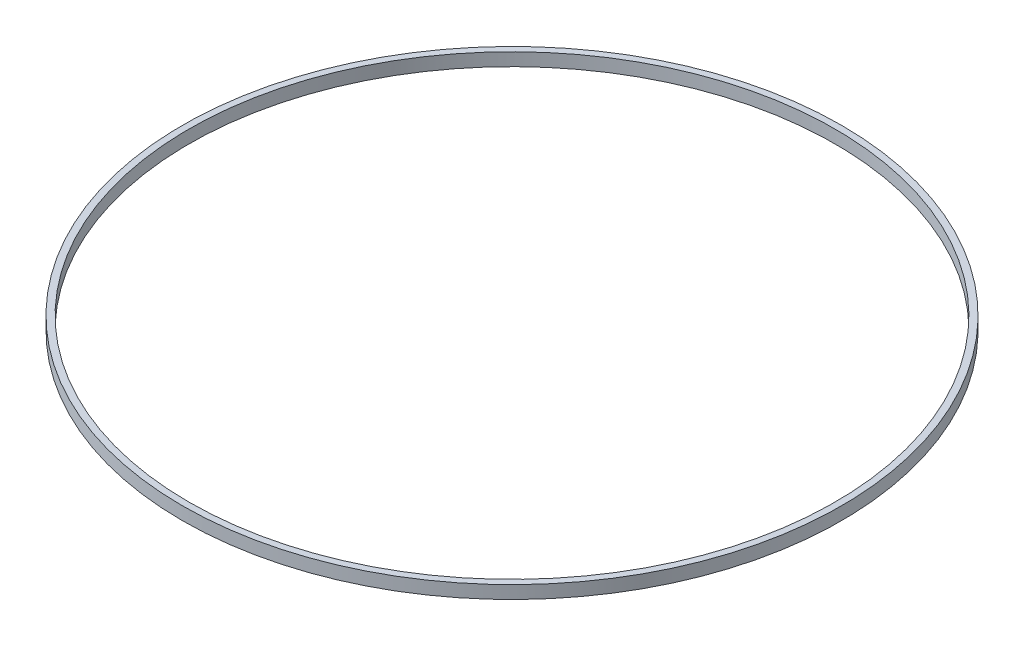
ISO-10303-21;
HEADER;
FILE_DESCRIPTION(('STEP AP214'),'2;1');
FILE_NAME('part.step','',(''),(''),'','','');
FILE_SCHEMA(('AUTOMOTIVE_DESIGN { 1 0 10303 214 1 1 1 1 }'));
ENDSEC;
DATA;
#1=APPLICATION_CONTEXT('core data for automotive mechanical design processes');
#2=APPLICATION_PROTOCOL_DEFINITION('international standard','automotive_design',2000,#1);
#3=PRODUCT_CONTEXT('',#1,'mechanical');
#4=PRODUCT('Part','Part','',(#3));
#5=PRODUCT_RELATED_PRODUCT_CATEGORY('part','',(#4));
#6=PRODUCT_DEFINITION_FORMATION('','',#4);
#7=PRODUCT_DEFINITION_CONTEXT('part definition',#1,'design');
#8=PRODUCT_DEFINITION('design','',#6,#7);
#9=PRODUCT_DEFINITION_SHAPE('','',#8);
#10=(LENGTH_UNIT() NAMED_UNIT(*) SI_UNIT(.MILLI.,.METRE.));
#11=(NAMED_UNIT(*) PLANE_ANGLE_UNIT() SI_UNIT($,.RADIAN.));
#12=(NAMED_UNIT(*) SI_UNIT($,.STERADIAN.) SOLID_ANGLE_UNIT());
#13=UNCERTAINTY_MEASURE_WITH_UNIT(LENGTH_MEASURE(1.E-05),#10,'distance_accuracy_value','');
#14=(GEOMETRIC_REPRESENTATION_CONTEXT(3) GLOBAL_UNCERTAINTY_ASSIGNED_CONTEXT((#13)) GLOBAL_UNIT_ASSIGNED_CONTEXT((#10,
#11,#12)) REPRESENTATION_CONTEXT('',''));
#15=CARTESIAN_POINT('',(0.,0.,0.));
#16=DIRECTION('',(0.,0.,1.));
#17=DIRECTION('',(1.,0.,0.));
#18=AXIS2_PLACEMENT_3D('',#15,#16,#17);
#19=CARTESIAN_POINT('',(0.,2.,0.));
#20=DIRECTION('',(0.,1.,0.));
#21=DIRECTION('',(0.,0.,1.));
#22=AXIS2_PLACEMENT_3D('',#19,#20,#21);
#23=PLANE('',#22);
#24=CARTESIAN_POINT('',(0.,2.,0.));
#25=DIRECTION('',(0.,1.,0.));
#26=DIRECTION('',(0.,0.,1.));
#27=AXIS2_PLACEMENT_3D('',#24,#25,#26);
#28=CIRCLE('',#27,51.);
#29=CARTESIAN_POINT('',(0.,2.,51.));
#30=VERTEX_POINT('',#29);
#31=EDGE_CURVE('E10',#30,#30,#28,.T.);
#32=ORIENTED_EDGE('',*,*,#31,.T.);
#33=EDGE_LOOP('',(#32));
#34=FACE_BOUND('',#33,.T.);
#35=CARTESIAN_POINT('',(0.,2.,0.));
#36=DIRECTION('',(0.,1.,0.));
#37=DIRECTION('',(0.,0.,1.));
#38=AXIS2_PLACEMENT_3D('',#35,#36,#37);
#39=CIRCLE('',#38,50.);
#40=CARTESIAN_POINT('',(0.,2.,50.));
#41=VERTEX_POINT('',#40);
#42=EDGE_CURVE('E42',#41,#41,#39,.T.);
#43=ORIENTED_EDGE('',*,*,#42,.F.);
#44=EDGE_LOOP('',(#43));
#45=FACE_BOUND('',#44,.T.);
#46=ADVANCED_FACE('F31',(#34,#45),#23,.T.);
#47=CARTESIAN_POINT('',(0.,0.,0.));
#48=DIRECTION('',(0.,1.,0.));
#49=DIRECTION('',(0.,0.,1.));
#50=AXIS2_PLACEMENT_3D('',#47,#48,#49);
#51=PLANE('',#50);
#52=CARTESIAN_POINT('',(0.,0.,0.));
#53=DIRECTION('',(0.,1.,0.));
#54=DIRECTION('',(0.,0.,1.));
#55=AXIS2_PLACEMENT_3D('',#52,#53,#54);
#56=CIRCLE('',#55,51.);
#57=CARTESIAN_POINT('',(0.,0.,51.));
#58=VERTEX_POINT('',#57);
#59=EDGE_CURVE('E35',#58,#58,#56,.T.);
#60=ORIENTED_EDGE('',*,*,#59,.F.);
#61=EDGE_LOOP('',(#60));
#62=FACE_BOUND('',#61,.T.);
#63=CARTESIAN_POINT('',(0.,0.,0.));
#64=DIRECTION('',(0.,1.,0.));
#65=DIRECTION('',(0.,0.,1.));
#66=AXIS2_PLACEMENT_3D('',#63,#64,#65);
#67=CIRCLE('',#66,50.);
#68=CARTESIAN_POINT('',(0.,0.,50.));
#69=VERTEX_POINT('',#68);
#70=EDGE_CURVE('E44',#69,#69,#67,.T.);
#71=ORIENTED_EDGE('',*,*,#70,.T.);
#72=EDGE_LOOP('',(#71));
#73=FACE_BOUND('',#72,.T.);
#74=ADVANCED_FACE('F54',(#62,#73),#51,.F.);
#75=CARTESIAN_POINT('',(0.,2.,0.));
#76=DIRECTION('',(0.,-1.,0.));
#77=DIRECTION('',(0.,0.,-1.));
#78=AXIS2_PLACEMENT_3D('',#75,#76,#77);
#79=CYLINDRICAL_SURFACE('',#78,51.);
#80=ORIENTED_EDGE('',*,*,#31,.F.);
#81=EDGE_LOOP('',(#80));
#82=FACE_BOUND('',#81,.T.);
#83=ORIENTED_EDGE('',*,*,#59,.T.);
#84=EDGE_LOOP('',(#83));
#85=FACE_BOUND('',#84,.T.);
#86=ADVANCED_FACE('F33',(#82,#85),#79,.T.);
#87=CARTESIAN_POINT('',(0.,2.,0.));
#88=DIRECTION('',(0.,-1.,0.));
#89=DIRECTION('',(0.,0.,-1.));
#90=AXIS2_PLACEMENT_3D('',#87,#88,#89);
#91=CYLINDRICAL_SURFACE('',#90,50.);
#92=ORIENTED_EDGE('',*,*,#42,.T.);
#93=EDGE_LOOP('',(#92));
#94=FACE_BOUND('',#93,.T.);
#95=ORIENTED_EDGE('',*,*,#70,.F.);
#96=EDGE_LOOP('',(#95));
#97=FACE_BOUND('',#96,.T.);
#98=ADVANCED_FACE('F50',(#94,#97),#91,.F.);
#99=CLOSED_SHELL('',(#46,#74,#86,#98));
#100=MANIFOLD_SOLID_BREP('B2',#99);
#101=ADVANCED_BREP_SHAPE_REPRESENTATION('',(#18,#100),#14);
#102=SHAPE_DEFINITION_REPRESENTATION(#9,#101);
ENDSEC;
END-ISO-10303-21;
